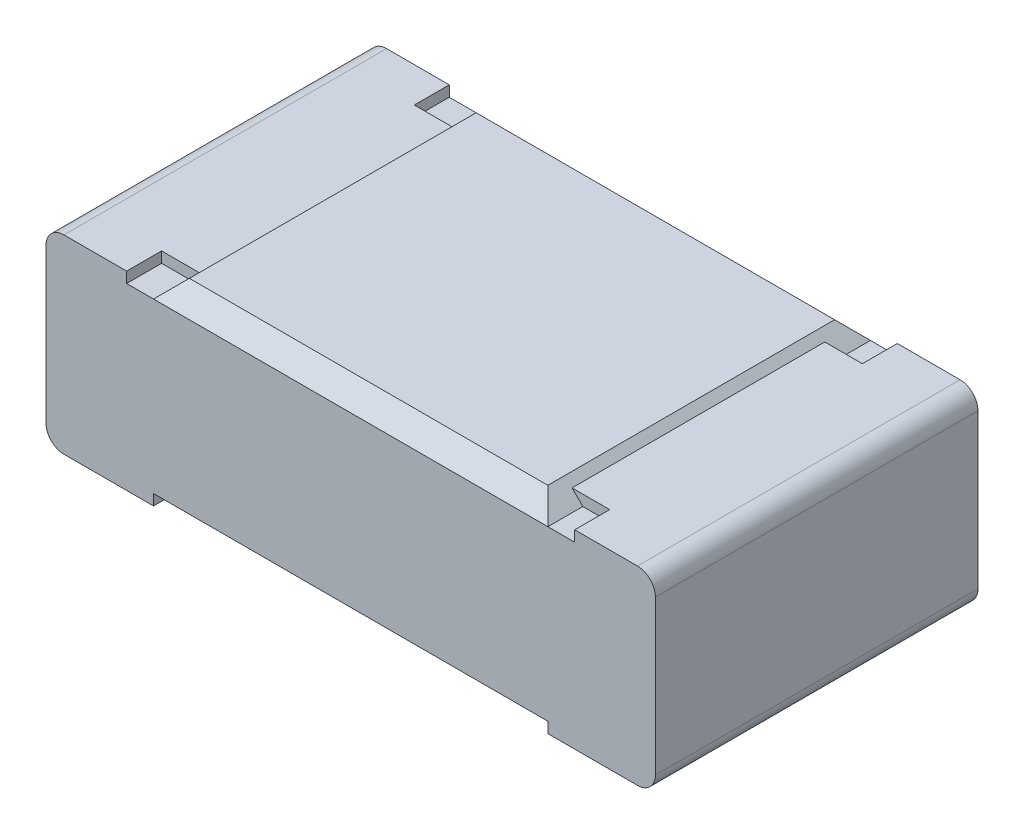
ISO-10303-21;
HEADER;
FILE_DESCRIPTION(('STEP AP214'),'2;1');
FILE_NAME('part.step','',(''),(''),'','','');
FILE_SCHEMA(('AUTOMOTIVE_DESIGN { 1 0 10303 214 1 1 1 1 }'));
ENDSEC;
DATA;
#1=APPLICATION_CONTEXT('core data for automotive mechanical design processes');
#2=APPLICATION_PROTOCOL_DEFINITION('international standard','automotive_design',2000,#1);
#3=PRODUCT_CONTEXT('',#1,'mechanical');
#4=PRODUCT('Part','Part','',(#3));
#5=PRODUCT_RELATED_PRODUCT_CATEGORY('part','',(#4));
#6=PRODUCT_DEFINITION_FORMATION('','',#4);
#7=PRODUCT_DEFINITION_CONTEXT('part definition',#1,'design');
#8=PRODUCT_DEFINITION('design','',#6,#7);
#9=PRODUCT_DEFINITION_SHAPE('','',#8);
#10=(LENGTH_UNIT() NAMED_UNIT(*) SI_UNIT(.MILLI.,.METRE.));
#11=(NAMED_UNIT(*) PLANE_ANGLE_UNIT() SI_UNIT($,.RADIAN.));
#12=(NAMED_UNIT(*) SI_UNIT($,.STERADIAN.) SOLID_ANGLE_UNIT());
#13=UNCERTAINTY_MEASURE_WITH_UNIT(LENGTH_MEASURE(1.E-05),#10,'distance_accuracy_value','');
#14=(GEOMETRIC_REPRESENTATION_CONTEXT(3) GLOBAL_UNCERTAINTY_ASSIGNED_CONTEXT((#13)) GLOBAL_UNIT_ASSIGNED_CONTEXT((#10,
#11,#12)) REPRESENTATION_CONTEXT('',''));
#15=CARTESIAN_POINT('',(0.,0.,0.));
#16=DIRECTION('',(0.,0.,1.));
#17=DIRECTION('',(1.,0.,0.));
#18=AXIS2_PLACEMENT_3D('',#15,#16,#17);
#19=CARTESIAN_POINT('',(-2.052710128787,-22.36241513081,-1.003337141905));
#20=DIRECTION('',(1.,0.,0.));
#21=DIRECTION('',(0.,0.,-1.));
#22=AXIS2_PLACEMENT_3D('',#19,#20,#21);
#23=PLANE('',#22);
#24=DIRECTION('',(0.,1.,0.));
#25=VECTOR('',#24,1.);
#26=CARTESIAN_POINT('',(-2.052710128787,-22.36241513081,-1.100837141905));
#27=LINE('',#26,#25);
#28=CARTESIAN_POINT('',(-2.052710128787,-22.3624151309644,-1.100837141905));
#29=VERTEX_POINT('',#28);
#30=CARTESIAN_POINT('',(-2.052710128787,-22.33241513081,-1.100837141905));
#31=VERTEX_POINT('',#30);
#32=EDGE_CURVE('E396',#29,#31,#27,.T.);
#33=ORIENTED_EDGE('',*,*,#32,.F.);
#34=DIRECTION('',(0.,0.,1.));
#35=VECTOR('',#34,1.);
#36=CARTESIAN_POINT('',(-2.052710128787,-22.3624151311376,-0.200837141905));
#37=LINE('',#36,#35);
#38=CARTESIAN_POINT('',(-2.052710128787,-22.3624151311376,-1.003337141905));
#39=VERTEX_POINT('',#38);
#40=EDGE_CURVE('E246',#39,#29,#37,.F.);
#41=ORIENTED_EDGE('',*,*,#40,.F.);
#42=DIRECTION('',(0.,1.,0.));
#43=VECTOR('',#42,1.);
#44=CARTESIAN_POINT('',(-2.052710128787,-22.36241513081,-1.003337141905));
#45=LINE('',#44,#43);
#46=CARTESIAN_POINT('',(-2.052710128787,-22.33241513081,-1.003337141905));
#47=VERTEX_POINT('',#46);
#48=EDGE_CURVE('E380',#39,#47,#45,.T.);
#49=ORIENTED_EDGE('',*,*,#48,.T.);
#50=DIRECTION('',(0.,0.,1.));
#51=VECTOR('',#50,1.);
#52=CARTESIAN_POINT('',(-2.052710128787,-22.33241513081,-0.200837141905));
#53=LINE('',#52,#51);
#54=EDGE_CURVE('E341',#31,#47,#53,.T.);
#55=ORIENTED_EDGE('',*,*,#54,.F.);
#56=EDGE_LOOP('',(#33,#41,#49,#55));
#57=FACE_BOUND('',#56,.T.);
#58=ADVANCED_FACE('F17',(#57),#23,.F.);
#59=CARTESIAN_POINT('',(-3.302710128787,-22.36241513081,-1.003337141905));
#60=DIRECTION('',(0.,0.,1.));
#61=DIRECTION('',(1.,0.,0.));
#62=AXIS2_PLACEMENT_3D('',#59,#60,#61);
#63=PLANE('',#62);
#64=DIRECTION('',(-1.,0.,0.));
#65=VECTOR('',#64,1.);
#66=CARTESIAN_POINT('',(-2.227710128787,-22.33241513081,-1.003337141905));
#67=LINE('',#66,#65);
#68=CARTESIAN_POINT('',(-2.15771012878251,-22.3324151308105,-1.003337141905));
#69=VERTEX_POINT('',#68);
#70=EDGE_CURVE('E337',#47,#69,#67,.T.);
#71=ORIENTED_EDGE('',*,*,#70,.F.);
#72=ORIENTED_EDGE('',*,*,#48,.F.);
#73=DIRECTION('',(-1.,5.24652203359E-10,0.));
#74=VECTOR('',#73,1.);
#75=CARTESIAN_POINT('',(-3.477710128525,-22.36241513039,-1.003337141905));
#76=LINE('',#75,#74);
#77=CARTESIAN_POINT('',(-2.12771012852529,-22.3624151310986,-1.003337141905));
#78=VERTEX_POINT('',#77);
#79=EDGE_CURVE('E225',#78,#39,#76,.F.);
#80=ORIENTED_EDGE('',*,*,#79,.F.);
#81=DIRECTION('',(-0.707106780815548,0.707106781557548,0.));
#82=VECTOR('',#81,1.);
#83=CARTESIAN_POINT('',(-2.127710128525,-22.3624151311,-1.003337141905));
#84=LINE('',#83,#82);
#85=EDGE_CURVE('E300',#69,#78,#84,.F.);
#86=ORIENTED_EDGE('',*,*,#85,.F.);
#87=EDGE_LOOP('',(#71,#72,#80,#86));
#88=FACE_BOUND('',#87,.T.);
#89=ADVANCED_FACE('F576',(#88),#63,.F.);
#90=CARTESIAN_POINT('',(-3.302710128787,-22.36241513081,-1.100837141905));
#91=DIRECTION('',(-1.,0.,0.));
#92=DIRECTION('',(0.,0.,1.));
#93=AXIS2_PLACEMENT_3D('',#90,#91,#92);
#94=PLANE('',#93);
#95=DIRECTION('',(0.,1.,0.));
#96=VECTOR('',#95,1.);
#97=CARTESIAN_POINT('',(-3.302710128787,-22.36241513081,-1.003337141905));
#98=LINE('',#97,#96);
#99=CARTESIAN_POINT('',(-3.302710128787,-22.33241513081,-1.003337141905));
#100=VERTEX_POINT('',#99);
#101=CARTESIAN_POINT('',(-3.302710128787,-22.3624151304818,-1.003337141905));
#102=VERTEX_POINT('',#101);
#103=EDGE_CURVE('E363',#100,#102,#98,.F.);
#104=ORIENTED_EDGE('',*,*,#103,.T.);
#105=DIRECTION('',(0.,0.,1.));
#106=VECTOR('',#105,1.);
#107=CARTESIAN_POINT('',(-3.302710128787,-22.3624151304818,-0.200837141905));
#108=LINE('',#107,#106);
#109=CARTESIAN_POINT('',(-3.302710128787,-22.362415130728,-1.100837141905));
#110=VERTEX_POINT('',#109);
#111=EDGE_CURVE('E376',#110,#102,#108,.T.);
#112=ORIENTED_EDGE('',*,*,#111,.F.);
#113=DIRECTION('',(0.,1.,0.));
#114=VECTOR('',#113,1.);
#115=CARTESIAN_POINT('',(-3.302710128787,-22.86241513081,-1.100837141905));
#116=LINE('',#115,#114);
#117=CARTESIAN_POINT('',(-3.302710128787,-22.33241513081,-1.100837141905));
#118=VERTEX_POINT('',#117);
#119=EDGE_CURVE('E236',#118,#110,#116,.F.);
#120=ORIENTED_EDGE('',*,*,#119,.F.);
#121=DIRECTION('',(0.,0.,1.));
#122=VECTOR('',#121,1.);
#123=CARTESIAN_POINT('',(-3.302710128787,-22.33241513081,-0.200837141905));
#124=LINE('',#123,#122);
#125=EDGE_CURVE('E322',#100,#118,#124,.F.);
#126=ORIENTED_EDGE('',*,*,#125,.F.);
#127=EDGE_LOOP('',(#104,#112,#120,#126));
#128=FACE_BOUND('',#127,.T.);
#129=ADVANCED_FACE('F927',(#128),#94,.F.);
#130=CARTESIAN_POINT('',(-3.302710128787,-22.36241513081,-1.003337141905));
#131=DIRECTION('',(0.,0.,1.));
#132=DIRECTION('',(1.,0.,0.));
#133=AXIS2_PLACEMENT_3D('',#130,#131,#132);
#134=PLANE('',#133);
#135=DIRECTION('',(-1.,5.24652203359E-10,0.));
#136=VECTOR('',#135,1.);
#137=CARTESIAN_POINT('',(-3.477710128525,-22.36241513039,-1.003337141905));
#138=LINE('',#137,#136);
#139=CARTESIAN_POINT('',(-3.22771012852519,-22.362415130521,-1.003337141905));
#140=VERTEX_POINT('',#139);
#141=EDGE_CURVE('E276',#102,#140,#138,.F.);
#142=ORIENTED_EDGE('',*,*,#141,.F.);
#143=ORIENTED_EDGE('',*,*,#103,.F.);
#144=DIRECTION('',(-1.,0.,0.));
#145=VECTOR('',#144,1.);
#146=CARTESIAN_POINT('',(-3.477710128787,-22.33241513081,-1.003337141905));
#147=LINE('',#146,#145);
#148=CARTESIAN_POINT('',(-3.19771012878276,-22.3324151308095,-1.003337141905));
#149=VERTEX_POINT('',#148);
#150=EDGE_CURVE('E326',#149,#100,#147,.T.);
#151=ORIENTED_EDGE('',*,*,#150,.F.);
#152=DIRECTION('',(-0.707106781557548,-0.707106780815548,0.));
#153=VECTOR('',#152,1.);
#154=CARTESIAN_POINT('',(-3.227710128525,-22.36241513052,-1.003337141905));
#155=LINE('',#154,#153);
#156=EDGE_CURVE('E299',#140,#149,#155,.F.);
#157=ORIENTED_EDGE('',*,*,#156,.F.);
#158=EDGE_LOOP('',(#142,#143,#151,#157));
#159=FACE_BOUND('',#158,.T.);
#160=ADVANCED_FACE('F633',(#159),#134,.F.);
#161=CARTESIAN_POINT('',(-2.052710128787,-22.36241513081,-0.200837141905));
#162=DIRECTION('',(1.,0.,0.));
#163=DIRECTION('',(0.,1.,0.));
#164=AXIS2_PLACEMENT_3D('',#161,#162,#163);
#165=PLANE('',#164);
#166=DIRECTION('',(0.,1.,0.));
#167=VECTOR('',#166,1.);
#168=CARTESIAN_POINT('',(-2.052710128787,-22.36241513081,-0.298337141905));
#169=LINE('',#168,#167);
#170=CARTESIAN_POINT('',(-2.052710128787,-22.33241513081,-0.298337141905));
#171=VERTEX_POINT('',#170);
#172=CARTESIAN_POINT('',(-2.052710128787,-22.3624151311376,-0.298337141905));
#173=VERTEX_POINT('',#172);
#174=EDGE_CURVE('E357',#171,#173,#169,.F.);
#175=ORIENTED_EDGE('',*,*,#174,.T.);
#176=DIRECTION('',(0.,0.,1.));
#177=VECTOR('',#176,1.);
#178=CARTESIAN_POINT('',(-2.052710128787,-22.3624151311376,-0.200837141905));
#179=LINE('',#178,#177);
#180=CARTESIAN_POINT('',(-2.052710128787,-22.3624151309644,-0.200837141905));
#181=VERTEX_POINT('',#180);
#182=EDGE_CURVE('E334',#181,#173,#179,.F.);
#183=ORIENTED_EDGE('',*,*,#182,.F.);
#184=DIRECTION('',(0.,1.,0.));
#185=VECTOR('',#184,1.);
#186=CARTESIAN_POINT('',(-2.052710128787,-22.36241513081,-0.200837141905));
#187=LINE('',#186,#185);
#188=CARTESIAN_POINT('',(-2.052710128787,-22.33241513081,-0.200837141904999));
#189=VERTEX_POINT('',#188);
#190=EDGE_CURVE('E359',#189,#181,#187,.F.);
#191=ORIENTED_EDGE('',*,*,#190,.F.);
#192=DIRECTION('',(0.,0.,1.));
#193=VECTOR('',#192,1.);
#194=CARTESIAN_POINT('',(-2.052710128787,-22.33241513081,-0.200837141905));
#195=LINE('',#194,#193);
#196=EDGE_CURVE('E338',#171,#189,#195,.T.);
#197=ORIENTED_EDGE('',*,*,#196,.F.);
#198=EDGE_LOOP('',(#175,#183,#191,#197));
#199=FACE_BOUND('',#198,.T.);
#200=ADVANCED_FACE('F598',(#199),#165,.F.);
#201=CARTESIAN_POINT('',(-2.052710128787,-22.36241513081,-0.298337141905));
#202=DIRECTION('',(0.,0.,-1.));
#203=DIRECTION('',(-1.,0.,0.));
#204=AXIS2_PLACEMENT_3D('',#201,#202,#203);
#205=PLANE('',#204);
#206=DIRECTION('',(-1.,5.24652203359E-10,0.));
#207=VECTOR('',#206,1.);
#208=CARTESIAN_POINT('',(-3.477710128525,-22.36241513039,-0.298337141905));
#209=LINE('',#208,#207);
#210=CARTESIAN_POINT('',(-2.12771012852529,-22.3624151310986,-0.298337141905));
#211=VERTEX_POINT('',#210);
#212=EDGE_CURVE('E351',#173,#211,#209,.T.);
#213=ORIENTED_EDGE('',*,*,#212,.F.);
#214=ORIENTED_EDGE('',*,*,#174,.F.);
#215=DIRECTION('',(-1.,0.,0.));
#216=VECTOR('',#215,1.);
#217=CARTESIAN_POINT('',(-2.227710128787,-22.33241513081,-0.298337141905));
#218=LINE('',#217,#216);
#219=CARTESIAN_POINT('',(-2.15771012878276,-22.3324151308105,-0.298337141905));
#220=VERTEX_POINT('',#219);
#221=EDGE_CURVE('E342',#220,#171,#218,.F.);
#222=ORIENTED_EDGE('',*,*,#221,.F.);
#223=DIRECTION('',(-0.707106780815548,0.707106781557548,0.));
#224=VECTOR('',#223,1.);
#225=CARTESIAN_POINT('',(-2.127710128525,-22.3624151311,-0.298337141905));
#226=LINE('',#225,#224);
#227=EDGE_CURVE('E345',#211,#220,#226,.T.);
#228=ORIENTED_EDGE('',*,*,#227,.F.);
#229=EDGE_LOOP('',(#213,#214,#222,#228));
#230=FACE_BOUND('',#229,.T.);
#231=ADVANCED_FACE('F566',(#230),#205,.F.);
#232=CARTESIAN_POINT('',(-2.227710128787,-22.33241513081,-0.200837141905));
#233=DIRECTION('',(0.,1.,0.));
#234=DIRECTION('',(-1.,0.,0.));
#235=AXIS2_PLACEMENT_3D('',#232,#233,#234);
#236=PLANE('',#235);
#237=ORIENTED_EDGE('',*,*,#54,.T.);
#238=ORIENTED_EDGE('',*,*,#70,.T.);
#239=DIRECTION('',(0.,0.,1.));
#240=VECTOR('',#239,1.);
#241=CARTESIAN_POINT('',(-2.15771012878276,-22.3324151308108,-0.200837141905));
#242=LINE('',#241,#240);
#243=EDGE_CURVE('E348',#220,#69,#242,.F.);
#244=ORIENTED_EDGE('',*,*,#243,.F.);
#245=ORIENTED_EDGE('',*,*,#221,.T.);
#246=ORIENTED_EDGE('',*,*,#196,.T.);
#247=DIRECTION('',(-1.,0.,0.));
#248=VECTOR('',#247,1.);
#249=CARTESIAN_POINT('',(-2.677710128787,-22.33241513081,-0.200837141905));
#250=LINE('',#249,#248);
#251=CARTESIAN_POINT('',(-1.877710128787,-22.33241513081,-0.200837141904999));
#252=VERTEX_POINT('',#251);
#253=EDGE_CURVE('E448',#189,#252,#250,.F.);
#254=ORIENTED_EDGE('',*,*,#253,.T.);
#255=DIRECTION('',(0.,0.,-1.));
#256=VECTOR('',#255,1.);
#257=CARTESIAN_POINT('',(-1.877710128787,-22.33241513081,-0.200837141905));
#258=LINE('',#257,#256);
#259=CARTESIAN_POINT('',(-1.877710128787,-22.33241513081,-1.100837141905));
#260=VERTEX_POINT('',#259);
#261=EDGE_CURVE('E198',#260,#252,#258,.F.);
#262=ORIENTED_EDGE('',*,*,#261,.F.);
#263=DIRECTION('',(-1.,0.,0.));
#264=VECTOR('',#263,1.);
#265=CARTESIAN_POINT('',(-2.677710128787,-22.33241513081,-1.100837141905));
#266=LINE('',#265,#264);
#267=EDGE_CURVE('E224',#31,#260,#266,.F.);
#268=ORIENTED_EDGE('',*,*,#267,.F.);
#269=EDGE_LOOP('',(#237,#238,#244,#245,#246,#254,#262,#268));
#270=FACE_BOUND('',#269,.T.);
#271=ADVANCED_FACE('F571',(#270),#236,.T.);
#272=CARTESIAN_POINT('',(-1.877710128787,-22.38241513081,-0.200837141905));
#273=DIRECTION('',(0.,0.,-1.));
#274=DIRECTION('',(-1.,0.,0.));
#275=AXIS2_PLACEMENT_3D('',#272,#273,#274);
#276=CYLINDRICAL_SURFACE('',#275,0.05);
#277=CARTESIAN_POINT('',(-1.877710128787,-22.38241513081,-1.100837141905));
#278=DIRECTION('',(0.,0.,-1.));
#279=DIRECTION('',(-1.,0.,0.));
#280=AXIS2_PLACEMENT_3D('',#277,#278,#279);
#281=CIRCLE('',#280,0.05);
#282=CARTESIAN_POINT('',(-1.827710128787,-22.38241513081,-1.100837141905));
#283=VERTEX_POINT('',#282);
#284=EDGE_CURVE('E20',#260,#283,#281,.T.);
#285=ORIENTED_EDGE('',*,*,#284,.F.);
#286=ORIENTED_EDGE('',*,*,#261,.T.);
#287=CARTESIAN_POINT('',(-1.877710128787,-22.38241513081,-0.200837141905));
#288=DIRECTION('',(0.,0.,-1.));
#289=DIRECTION('',(-1.,0.,0.));
#290=AXIS2_PLACEMENT_3D('',#287,#288,#289);
#291=CIRCLE('',#290,0.05);
#292=CARTESIAN_POINT('',(-1.827710128787,-22.38241513081,-0.200837141904999));
#293=VERTEX_POINT('',#292);
#294=EDGE_CURVE('E209',#252,#293,#291,.T.);
#295=ORIENTED_EDGE('',*,*,#294,.T.);
#296=DIRECTION('',(0.,0.,-1.));
#297=VECTOR('',#296,1.);
#298=CARTESIAN_POINT('',(-1.827710128787,-22.38241513081,-0.200837141905));
#299=LINE('',#298,#297);
#300=EDGE_CURVE('E203',#283,#293,#299,.F.);
#301=ORIENTED_EDGE('',*,*,#300,.F.);
#302=EDGE_LOOP('',(#285,#286,#295,#301));
#303=FACE_BOUND('',#302,.T.);
#304=ADVANCED_FACE('F205',(#303),#276,.T.);
#305=CARTESIAN_POINT('',(-1.827710128787,-22.38241513081,-0.200837141905));
#306=DIRECTION('',(1.,0.,0.));
#307=DIRECTION('',(0.,0.,-1.));
#308=AXIS2_PLACEMENT_3D('',#305,#306,#307);
#309=PLANE('',#308);
#310=DIRECTION('',(0.,1.,0.));
#311=VECTOR('',#310,1.);
#312=CARTESIAN_POINT('',(-1.827710128787,-22.86241513081,-1.100837141905));
#313=LINE('',#312,#311);
#314=CARTESIAN_POINT('',(-1.827710128787,-22.81241513081,-1.100837141905));
#315=VERTEX_POINT('',#314);
#316=EDGE_CURVE('E215',#283,#315,#313,.F.);
#317=ORIENTED_EDGE('',*,*,#316,.F.);
#318=ORIENTED_EDGE('',*,*,#300,.T.);
#319=DIRECTION('',(0.,1.,0.));
#320=VECTOR('',#319,1.);
#321=CARTESIAN_POINT('',(-1.827710128787,-22.86241513081,-0.200837141904999));
#322=LINE('',#321,#320);
#323=CARTESIAN_POINT('',(-1.827710128787,-22.81241513081,-0.200837141904999));
#324=VERTEX_POINT('',#323);
#325=EDGE_CURVE('E446',#293,#324,#322,.F.);
#326=ORIENTED_EDGE('',*,*,#325,.T.);
#327=DIRECTION('',(0.,0.,-1.));
#328=VECTOR('',#327,1.);
#329=CARTESIAN_POINT('',(-1.827710128787,-22.81241513081,-0.200837141905));
#330=LINE('',#329,#328);
#331=EDGE_CURVE('E212',#315,#324,#330,.F.);
#332=ORIENTED_EDGE('',*,*,#331,.F.);
#333=EDGE_LOOP('',(#317,#318,#326,#332));
#334=FACE_BOUND('',#333,.T.);
#335=ADVANCED_FACE('F216',(#334),#309,.T.);
#336=CARTESIAN_POINT('',(-1.877710128787,-22.81241513081,-0.200837141905));
#337=DIRECTION('',(0.,0.,-1.));
#338=DIRECTION('',(-1.,0.,0.));
#339=AXIS2_PLACEMENT_3D('',#336,#337,#338);
#340=CYLINDRICAL_SURFACE('',#339,0.05);
#341=CARTESIAN_POINT('',(-1.877710128787,-22.81241513081,-1.100837141905));
#342=DIRECTION('',(0.,0.,-1.));
#343=DIRECTION('',(-1.,0.,0.));
#344=AXIS2_PLACEMENT_3D('',#341,#342,#343);
#345=CIRCLE('',#344,0.05);
#346=CARTESIAN_POINT('',(-1.877710128787,-22.86241513081,-1.100837141905));
#347=VERTEX_POINT('',#346);
#348=EDGE_CURVE('E220',#315,#347,#345,.T.);
#349=ORIENTED_EDGE('',*,*,#348,.F.);
#350=ORIENTED_EDGE('',*,*,#331,.T.);
#351=CARTESIAN_POINT('',(-1.877710128787,-22.81241513081,-0.200837141905));
#352=DIRECTION('',(0.,0.,-1.));
#353=DIRECTION('',(-1.,0.,0.));
#354=AXIS2_PLACEMENT_3D('',#351,#352,#353);
#355=CIRCLE('',#354,0.05);
#356=CARTESIAN_POINT('',(-1.877710128787,-22.86241513081,-0.200837141904999));
#357=VERTEX_POINT('',#356);
#358=EDGE_CURVE('E443',#324,#357,#355,.T.);
#359=ORIENTED_EDGE('',*,*,#358,.T.);
#360=DIRECTION('',(0.,0.,1.));
#361=VECTOR('',#360,1.);
#362=CARTESIAN_POINT('',(-1.877710128787,-22.86241513081,-0.200837141905));
#363=LINE('',#362,#361);
#364=EDGE_CURVE('E331',#347,#357,#363,.T.);
#365=ORIENTED_EDGE('',*,*,#364,.F.);
#366=EDGE_LOOP('',(#349,#350,#359,#365));
#367=FACE_BOUND('',#366,.T.);
#368=ADVANCED_FACE('F461',(#367),#340,.T.);
#369=CARTESIAN_POINT('',(-3.477710128787,-22.81241513081,-0.200837141905));
#370=DIRECTION('',(0.,0.,-1.));
#371=DIRECTION('',(-1.,0.,0.));
#372=AXIS2_PLACEMENT_3D('',#369,#370,#371);
#373=CYLINDRICAL_SURFACE('',#372,0.05);
#374=CARTESIAN_POINT('',(-3.477710128787,-22.81241513081,-1.100837141905));
#375=DIRECTION('',(0.,0.,-1.));
#376=DIRECTION('',(-1.,0.,0.));
#377=AXIS2_PLACEMENT_3D('',#374,#375,#376);
#378=CIRCLE('',#377,0.05);
#379=CARTESIAN_POINT('',(-3.477710128787,-22.86241513081,-1.100837141905));
#380=VERTEX_POINT('',#379);
#381=CARTESIAN_POINT('',(-3.527710128787,-22.81241513081,-1.100837141905));
#382=VERTEX_POINT('',#381);
#383=EDGE_CURVE('E454',#380,#382,#378,.T.);
#384=ORIENTED_EDGE('',*,*,#383,.F.);
#385=DIRECTION('',(0.,0.,1.));
#386=VECTOR('',#385,1.);
#387=CARTESIAN_POINT('',(-3.477710128787,-22.86241513081,-0.200837141905));
#388=LINE('',#387,#386);
#389=CARTESIAN_POINT('',(-3.477710128787,-22.86241513081,-0.200837141905001));
#390=VERTEX_POINT('',#389);
#391=EDGE_CURVE('E269',#390,#380,#388,.F.);
#392=ORIENTED_EDGE('',*,*,#391,.F.);
#393=CARTESIAN_POINT('',(-3.477710128787,-22.81241513081,-0.200837141905));
#394=DIRECTION('',(0.,0.,-1.));
#395=DIRECTION('',(-1.,0.,0.));
#396=AXIS2_PLACEMENT_3D('',#393,#394,#395);
#397=CIRCLE('',#396,0.05);
#398=CARTESIAN_POINT('',(-3.527710128787,-22.81241513081,-0.200837141905001));
#399=VERTEX_POINT('',#398);
#400=EDGE_CURVE('E440',#390,#399,#397,.T.);
#401=ORIENTED_EDGE('',*,*,#400,.T.);
#402=DIRECTION('',(0.,0.,1.));
#403=VECTOR('',#402,1.);
#404=CARTESIAN_POINT('',(-3.527710128787,-22.81241513081,-0.200837141905));
#405=LINE('',#404,#403);
#406=EDGE_CURVE('E327',#382,#399,#405,.T.);
#407=ORIENTED_EDGE('',*,*,#406,.F.);
#408=EDGE_LOOP('',(#384,#392,#401,#407));
#409=FACE_BOUND('',#408,.T.);
#410=ADVANCED_FACE('F611',(#409),#373,.T.);
#411=CARTESIAN_POINT('',(-3.527710128787,-22.81241513081,-0.200837141905));
#412=DIRECTION('',(-1.,0.,0.));
#413=DIRECTION('',(0.,-1.,0.));
#414=AXIS2_PLACEMENT_3D('',#411,#412,#413);
#415=PLANE('',#414);
#416=DIRECTION('',(0.,1.,0.));
#417=VECTOR('',#416,1.);
#418=CARTESIAN_POINT('',(-3.527710128787,-22.86241513081,-1.100837141905));
#419=LINE('',#418,#417);
#420=CARTESIAN_POINT('',(-3.527710128787,-22.38241513081,-1.100837141905));
#421=VERTEX_POINT('',#420);
#422=EDGE_CURVE('E453',#382,#421,#419,.T.);
#423=ORIENTED_EDGE('',*,*,#422,.F.);
#424=ORIENTED_EDGE('',*,*,#406,.T.);
#425=DIRECTION('',(0.,1.,0.));
#426=VECTOR('',#425,1.);
#427=CARTESIAN_POINT('',(-3.527710128787,-22.86241513081,-0.200837141905001));
#428=LINE('',#427,#426);
#429=CARTESIAN_POINT('',(-3.527710128787,-22.38241513081,-0.200837141905001));
#430=VERTEX_POINT('',#429);
#431=EDGE_CURVE('E439',#399,#430,#428,.T.);
#432=ORIENTED_EDGE('',*,*,#431,.T.);
#433=DIRECTION('',(0.,0.,-1.));
#434=VECTOR('',#433,1.);
#435=CARTESIAN_POINT('',(-3.527710128787,-22.38241513081,-0.200837141905));
#436=LINE('',#435,#434);
#437=EDGE_CURVE('E323',#421,#430,#436,.F.);
#438=ORIENTED_EDGE('',*,*,#437,.F.);
#439=EDGE_LOOP('',(#423,#424,#432,#438));
#440=FACE_BOUND('',#439,.T.);
#441=ADVANCED_FACE('F615',(#440),#415,.T.);
#442=CARTESIAN_POINT('',(-3.477710128787,-22.38241513081,-0.200837141905));
#443=DIRECTION('',(0.,0.,-1.));
#444=DIRECTION('',(-1.,0.,0.));
#445=AXIS2_PLACEMENT_3D('',#442,#443,#444);
#446=CYLINDRICAL_SURFACE('',#445,0.05);
#447=CARTESIAN_POINT('',(-3.477710128787,-22.38241513081,-1.100837141905));
#448=DIRECTION('',(0.,0.,-1.));
#449=DIRECTION('',(-1.,0.,0.));
#450=AXIS2_PLACEMENT_3D('',#447,#448,#449);
#451=CIRCLE('',#450,0.05);
#452=CARTESIAN_POINT('',(-3.477710128787,-22.33241513081,-1.100837141905));
#453=VERTEX_POINT('',#452);
#454=EDGE_CURVE('E449',#421,#453,#451,.T.);
#455=ORIENTED_EDGE('',*,*,#454,.F.);
#456=ORIENTED_EDGE('',*,*,#437,.T.);
#457=CARTESIAN_POINT('',(-3.477710128787,-22.38241513081,-0.200837141905));
#458=DIRECTION('',(0.,0.,-1.));
#459=DIRECTION('',(-1.,0.,0.));
#460=AXIS2_PLACEMENT_3D('',#457,#458,#459);
#461=CIRCLE('',#460,0.05);
#462=CARTESIAN_POINT('',(-3.477710128787,-22.33241513081,-0.200837141905));
#463=VERTEX_POINT('',#462);
#464=EDGE_CURVE('E436',#430,#463,#461,.T.);
#465=ORIENTED_EDGE('',*,*,#464,.T.);
#466=DIRECTION('',(0.,0.,1.));
#467=VECTOR('',#466,1.);
#468=CARTESIAN_POINT('',(-3.477710128787,-22.33241513081,-0.200837141905));
#469=LINE('',#468,#467);
#470=EDGE_CURVE('E317',#453,#463,#469,.T.);
#471=ORIENTED_EDGE('',*,*,#470,.F.);
#472=EDGE_LOOP('',(#455,#456,#465,#471));
#473=FACE_BOUND('',#472,.T.);
#474=ADVANCED_FACE('F619',(#473),#446,.T.);
#475=CARTESIAN_POINT('',(-3.477710128787,-22.33241513081,-0.200837141905));
#476=DIRECTION('',(0.,1.,0.));
#477=DIRECTION('',(-1.,0.,0.));
#478=AXIS2_PLACEMENT_3D('',#475,#476,#477);
#479=PLANE('',#478);
#480=DIRECTION('',(0.,0.,1.));
#481=VECTOR('',#480,1.);
#482=CARTESIAN_POINT('',(-3.302710128787,-22.33241513081,-0.298337141905));
#483=LINE('',#482,#481);
#484=CARTESIAN_POINT('',(-3.302710128787,-22.33241513081,-0.200837141905001));
#485=VERTEX_POINT('',#484);
#486=CARTESIAN_POINT('',(-3.302710128787,-22.33241513081,-0.298337141905001));
#487=VERTEX_POINT('',#486);
#488=EDGE_CURVE('E307',#485,#487,#483,.F.);
#489=ORIENTED_EDGE('',*,*,#488,.T.);
#490=DIRECTION('',(-1.,0.,0.));
#491=VECTOR('',#490,1.);
#492=CARTESIAN_POINT('',(-2.052710128787,-22.33241513081,-0.298337141905));
#493=LINE('',#492,#491);
#494=CARTESIAN_POINT('',(-3.19771012878219,-22.3324151308098,-0.298337141905));
#495=VERTEX_POINT('',#494);
#496=EDGE_CURVE('E306',#487,#495,#493,.F.);
#497=ORIENTED_EDGE('',*,*,#496,.T.);
#498=DIRECTION('',(0.,0.,1.));
#499=VECTOR('',#498,1.);
#500=CARTESIAN_POINT('',(-3.19771012878276,-22.3324151308092,-1.100837141905));
#501=LINE('',#500,#499);
#502=EDGE_CURVE('E289',#149,#495,#501,.T.);
#503=ORIENTED_EDGE('',*,*,#502,.F.);
#504=ORIENTED_EDGE('',*,*,#150,.T.);
#505=ORIENTED_EDGE('',*,*,#125,.T.);
#506=DIRECTION('',(-1.,0.,0.));
#507=VECTOR('',#506,1.);
#508=CARTESIAN_POINT('',(-2.677710128787,-22.33241513081,-1.100837141905));
#509=LINE('',#508,#507);
#510=EDGE_CURVE('E452',#453,#118,#509,.F.);
#511=ORIENTED_EDGE('',*,*,#510,.F.);
#512=ORIENTED_EDGE('',*,*,#470,.T.);
#513=DIRECTION('',(-1.,0.,0.));
#514=VECTOR('',#513,1.);
#515=CARTESIAN_POINT('',(-2.677710128787,-22.33241513081,-0.200837141905));
#516=LINE('',#515,#514);
#517=EDGE_CURVE('E438',#463,#485,#516,.F.);
#518=ORIENTED_EDGE('',*,*,#517,.T.);
#519=EDGE_LOOP('',(#489,#497,#503,#504,#505,#511,#512,#518));
#520=FACE_BOUND('',#519,.T.);
#521=ADVANCED_FACE('F623',(#520),#479,.T.);
#522=CARTESIAN_POINT('',(-3.302710128787,-22.36241513081,-0.298337141905));
#523=DIRECTION('',(-1.,0.,0.));
#524=DIRECTION('',(0.,-1.,0.));
#525=AXIS2_PLACEMENT_3D('',#522,#523,#524);
#526=PLANE('',#525);
#527=DIRECTION('',(0.,1.,0.));
#528=VECTOR('',#527,1.);
#529=CARTESIAN_POINT('',(-3.302710128787,-22.86241513081,-0.200837141905001));
#530=LINE('',#529,#528);
#531=CARTESIAN_POINT('',(-3.302710128787,-22.362415130728,-0.200837141905001));
#532=VERTEX_POINT('',#531);
#533=EDGE_CURVE('E646',#485,#532,#530,.F.);
#534=ORIENTED_EDGE('',*,*,#533,.T.);
#535=DIRECTION('',(0.,0.,1.));
#536=VECTOR('',#535,1.);
#537=CARTESIAN_POINT('',(-3.302710128787,-22.3624151304818,-0.200837141905));
#538=LINE('',#537,#536);
#539=CARTESIAN_POINT('',(-3.302710128787,-22.3624151304818,-0.298337141905001));
#540=VERTEX_POINT('',#539);
#541=EDGE_CURVE('E644',#540,#532,#538,.T.);
#542=ORIENTED_EDGE('',*,*,#541,.F.);
#543=DIRECTION('',(0.,1.,0.));
#544=VECTOR('',#543,1.);
#545=CARTESIAN_POINT('',(-3.302710128787,-22.36241513081,-0.298337141905002));
#546=LINE('',#545,#544);
#547=EDGE_CURVE('E303',#540,#487,#546,.T.);
#548=ORIENTED_EDGE('',*,*,#547,.T.);
#549=ORIENTED_EDGE('',*,*,#488,.F.);
#550=EDGE_LOOP('',(#534,#542,#548,#549));
#551=FACE_BOUND('',#550,.T.);
#552=ADVANCED_FACE('F661',(#551),#526,.F.);
#553=CARTESIAN_POINT('',(-2.052710128787,-22.36241513081,-0.298337141905));
#554=DIRECTION('',(0.,0.,-1.));
#555=DIRECTION('',(-1.,0.,0.));
#556=AXIS2_PLACEMENT_3D('',#553,#554,#555);
#557=PLANE('',#556);
#558=ORIENTED_EDGE('',*,*,#496,.F.);
#559=ORIENTED_EDGE('',*,*,#547,.F.);
#560=DIRECTION('',(-1.,5.24652203359E-10,0.));
#561=VECTOR('',#560,1.);
#562=CARTESIAN_POINT('',(-3.477710128525,-22.36241513039,-0.298337141905));
#563=LINE('',#562,#561);
#564=CARTESIAN_POINT('',(-3.227710128525,-22.3624151305203,-0.298337141905));
#565=VERTEX_POINT('',#564);
#566=EDGE_CURVE('E310',#565,#540,#563,.T.);
#567=ORIENTED_EDGE('',*,*,#566,.F.);
#568=DIRECTION('',(-0.707106781557548,-0.707106780815548,0.));
#569=VECTOR('',#568,1.);
#570=CARTESIAN_POINT('',(-3.227710128525,-22.36241513052,-0.298337141905));
#571=LINE('',#570,#569);
#572=EDGE_CURVE('E285',#495,#565,#571,.T.);
#573=ORIENTED_EDGE('',*,*,#572,.F.);
#574=EDGE_LOOP('',(#558,#559,#567,#573));
#575=FACE_BOUND('',#574,.T.);
#576=ADVANCED_FACE('F640',(#575),#557,.F.);
#577=CARTESIAN_POINT('',(-2.127710128525,-22.3624151311,-0.200837141905));
#578=DIRECTION('',(0.707106781557548,0.707106780815548,0.));
#579=DIRECTION('',(-0.707106780815548,0.707106781557548,0.));
#580=AXIS2_PLACEMENT_3D('',#577,#578,#579);
#581=PLANE('',#580);
#582=DIRECTION('',(-0.577350268866299,0.577350269502745,-0.577350269199834));
#583=VECTOR('',#582,1.);
#584=CARTESIAN_POINT('',(-2.127710128525,-22.3624151310986,-0.200837141903555));
#585=LINE('',#584,#583);
#586=CARTESIAN_POINT('',(-2.12771012860958,-22.3624151309421,-0.200837141916722));
#587=VERTEX_POINT('',#586);
#588=CARTESIAN_POINT('',(-2.177710128498,-22.3124151310711,-0.25083714190544));
#589=VERTEX_POINT('',#588);
#590=EDGE_CURVE('E294',#587,#589,#585,.T.);
#591=ORIENTED_EDGE('',*,*,#590,.F.);
#592=DIRECTION('',(0.,0.,1.));
#593=VECTOR('',#592,1.);
#594=CARTESIAN_POINT('',(-2.127710128525,-22.3624151310983,-0.200837141905));
#595=LINE('',#594,#593);
#596=EDGE_CURVE('E354',#211,#587,#595,.T.);
#597=ORIENTED_EDGE('',*,*,#596,.F.);
#598=ORIENTED_EDGE('',*,*,#227,.T.);
#599=ORIENTED_EDGE('',*,*,#243,.T.);
#600=ORIENTED_EDGE('',*,*,#85,.T.);
#601=DIRECTION('',(0.,0.,1.));
#602=VECTOR('',#601,1.);
#603=CARTESIAN_POINT('',(-2.127710128525,-22.3624151310983,-0.200837141905));
#604=LINE('',#603,#602);
#605=CARTESIAN_POINT('',(-2.127710128525,-22.3624151309546,-1.100837141905));
#606=VERTEX_POINT('',#605);
#607=EDGE_CURVE('E228',#606,#78,#604,.T.);
#608=ORIENTED_EDGE('',*,*,#607,.F.);
#609=DIRECTION('',(0.577350268866299,-0.577350269502745,-0.577350269199833));
#610=VECTOR('',#609,1.);
#611=CARTESIAN_POINT('',(-2.177710128498,-22.3124151310719,-1.05083714190312));
#612=LINE('',#611,#610);
#613=CARTESIAN_POINT('',(-2.17771012862838,-22.3124151308987,-1.05083714173041));
#614=VERTEX_POINT('',#613);
#615=EDGE_CURVE('E249',#614,#606,#612,.T.);
#616=ORIENTED_EDGE('',*,*,#615,.F.);
#617=DIRECTION('',(0.,0.,1.));
#618=VECTOR('',#617,1.);
#619=CARTESIAN_POINT('',(-2.177710128498,-22.3124151310723,-0.650837141905));
#620=LINE('',#619,#618);
#621=EDGE_CURVE('E297',#589,#614,#620,.F.);
#622=ORIENTED_EDGE('',*,*,#621,.F.);
#623=EDGE_LOOP('',(#591,#597,#598,#599,#600,#608,#616,#622));
#624=FACE_BOUND('',#623,.T.);
#625=ADVANCED_FACE('F559',(#624),#581,.T.);
#626=CARTESIAN_POINT('',(-2.677710128498,-22.31241513081,-0.650837141905));
#627=DIRECTION('',(5.24652203359E-10,1.,0.));
#628=DIRECTION('',(-1.,5.24652203359E-10,0.));
#629=AXIS2_PLACEMENT_3D('',#626,#627,#628);
#630=PLANE('',#629);
#631=DIRECTION('',(1.,-2.62325390485111E-10,-2.62325390485111E-10));
#632=VECTOR('',#631,1.);
#633=CARTESIAN_POINT('',(-3.227710128525,-22.312415130795,-0.250837141629998));
#634=LINE('',#633,#632);
#635=CARTESIAN_POINT('',(-3.17771012853192,-22.3124151306779,-0.250837141741322));
#636=VERTEX_POINT('',#635);
#637=EDGE_CURVE('E290',#589,#636,#634,.F.);
#638=ORIENTED_EDGE('',*,*,#637,.F.);
#639=ORIENTED_EDGE('',*,*,#621,.T.);
#640=DIRECTION('',(1.,-2.62326806565436E-10,2.62326806565436E-10));
#641=VECTOR('',#640,1.);
#642=CARTESIAN_POINT('',(-2.127710128525,-22.312415130825,-1.05083714163));
#643=LINE('',#642,#641);
#644=CARTESIAN_POINT('',(-3.17771012849876,-22.3124151305489,-1.0508371419053));
#645=VERTEX_POINT('',#644);
#646=EDGE_CURVE('E263',#645,#614,#643,.T.);
#647=ORIENTED_EDGE('',*,*,#646,.F.);
#648=DIRECTION('',(0.,0.,1.));
#649=VECTOR('',#648,1.);
#650=CARTESIAN_POINT('',(-3.17771012850027,-22.3124151305477,-1.100837141905));
#651=LINE('',#650,#649);
#652=EDGE_CURVE('E288',#636,#645,#651,.F.);
#653=ORIENTED_EDGE('',*,*,#652,.F.);
#654=EDGE_LOOP('',(#638,#639,#647,#653));
#655=FACE_BOUND('',#654,.T.);
#656=ADVANCED_FACE('F585',(#655),#630,.T.);
#657=CARTESIAN_POINT('',(-3.227710128525,-22.36241513052,-1.100837141905));
#658=DIRECTION('',(-0.707106780815548,0.707106781557548,0.));
#659=DIRECTION('',(-0.707106781557548,-0.707106780815548,0.));
#660=AXIS2_PLACEMENT_3D('',#657,#658,#659);
#661=PLANE('',#660);
#662=DIRECTION('',(0.577350269512954,0.577350268876503,0.57735026917942));
#663=VECTOR('',#662,1.);
#664=CARTESIAN_POINT('',(-3.227710128525,-22.3624151305214,-1.10083714190356));
#665=LINE('',#664,#663);
#666=CARTESIAN_POINT('',(-3.22771012853708,-22.3624151306052,-1.10083714191672));
#667=VERTEX_POINT('',#666);
#668=EDGE_CURVE('E266',#667,#645,#665,.T.);
#669=ORIENTED_EDGE('',*,*,#668,.F.);
#670=DIRECTION('',(0.,0.,1.));
#671=VECTOR('',#670,1.);
#672=CARTESIAN_POINT('',(-3.227710128525,-22.3624151305212,-0.200837141905));
#673=LINE('',#672,#671);
#674=EDGE_CURVE('E272',#140,#667,#673,.F.);
#675=ORIENTED_EDGE('',*,*,#674,.F.);
#676=ORIENTED_EDGE('',*,*,#156,.T.);
#677=ORIENTED_EDGE('',*,*,#502,.T.);
#678=ORIENTED_EDGE('',*,*,#572,.T.);
#679=DIRECTION('',(0.,0.,1.));
#680=VECTOR('',#679,1.);
#681=CARTESIAN_POINT('',(-3.227710128525,-22.3624151305212,-0.200837141905));
#682=LINE('',#681,#680);
#683=CARTESIAN_POINT('',(-3.227710128525,-22.3624151305203,-0.200837141905));
#684=VERTEX_POINT('',#683);
#685=EDGE_CURVE('E313',#684,#565,#682,.F.);
#686=ORIENTED_EDGE('',*,*,#685,.F.);
#687=DIRECTION('',(-0.577350269512955,-0.577350268876505,0.577350269179418));
#688=VECTOR('',#687,1.);
#689=CARTESIAN_POINT('',(-3.177710128498,-22.3124151305481,-0.250837141903115));
#690=LINE('',#689,#688);
#691=EDGE_CURVE('E293',#636,#684,#690,.T.);
#692=ORIENTED_EDGE('',*,*,#691,.F.);
#693=ORIENTED_EDGE('',*,*,#652,.T.);
#694=EDGE_LOOP('',(#669,#675,#676,#677,#678,#686,#692,#693));
#695=FACE_BOUND('',#694,.T.);
#696=ADVANCED_FACE('F589',(#695),#661,.T.);
#697=CARTESIAN_POINT('',(-3.227710128787,-22.86241513081,-0.200837141905));
#698=DIRECTION('',(0.,-1.,0.));
#699=DIRECTION('',(1.,0.,0.));
#700=AXIS2_PLACEMENT_3D('',#697,#698,#699);
#701=PLANE('',#700);
#702=DIRECTION('',(-1.,0.,0.));
#703=VECTOR('',#702,1.);
#704=CARTESIAN_POINT('',(-2.677710128787,-22.86241513081,-1.100837141905));
#705=LINE('',#704,#703);
#706=CARTESIAN_POINT('',(-3.227710128787,-22.86241513081,-1.100837141905));
#707=VERTEX_POINT('',#706);
#708=EDGE_CURVE('E456',#707,#380,#705,.T.);
#709=ORIENTED_EDGE('',*,*,#708,.F.);
#710=DIRECTION('',(0.,0.,1.));
#711=VECTOR('',#710,1.);
#712=CARTESIAN_POINT('',(-3.227710128787,-22.86241513081,-0.200837141905));
#713=LINE('',#712,#711);
#714=CARTESIAN_POINT('',(-3.227710128787,-22.86241513081,-0.200837141905));
#715=VERTEX_POINT('',#714);
#716=EDGE_CURVE('E279',#715,#707,#713,.F.);
#717=ORIENTED_EDGE('',*,*,#716,.F.);
#718=DIRECTION('',(-1.,0.,0.));
#719=VECTOR('',#718,1.);
#720=CARTESIAN_POINT('',(-2.677710128787,-22.86241513081,-0.200837141905));
#721=LINE('',#720,#719);
#722=EDGE_CURVE('E442',#715,#390,#721,.T.);
#723=ORIENTED_EDGE('',*,*,#722,.T.);
#724=ORIENTED_EDGE('',*,*,#391,.T.);
#725=EDGE_LOOP('',(#709,#717,#723,#724));
#726=FACE_BOUND('',#725,.T.);
#727=ADVANCED_FACE('F607',(#726),#701,.T.);
#728=CARTESIAN_POINT('',(-2.127710128525,-22.3624151311,-1.100837141905));
#729=DIRECTION('',(3.70986127618863E-10,0.707106781186548,-0.707106781186548));
#730=DIRECTION('',(0.,0.707106781186548,0.707106781186548));
#731=AXIS2_PLACEMENT_3D('',#728,#729,#730);
#732=PLANE('',#731);
#733=ORIENTED_EDGE('',*,*,#646,.T.);
#734=ORIENTED_EDGE('',*,*,#615,.T.);
#735=DIRECTION('',(-1.,0.,0.));
#736=VECTOR('',#735,1.);
#737=CARTESIAN_POINT('',(-2.677710128787,-22.36241513052,-1.100837141905));
#738=LINE('',#737,#736);
#739=EDGE_CURVE('E243',#667,#606,#738,.F.);
#740=ORIENTED_EDGE('',*,*,#739,.F.);
#741=ORIENTED_EDGE('',*,*,#668,.T.);
#742=EDGE_LOOP('',(#733,#734,#740,#741));
#743=FACE_BOUND('',#742,.T.);
#744=ADVANCED_FACE('F582',(#743),#732,.T.);
#745=CARTESIAN_POINT('',(-3.477710128525,-22.36241513039,-0.200837141905));
#746=DIRECTION('',(5.24652203359E-10,1.,0.));
#747=DIRECTION('',(-1.,5.24652203359E-10,0.));
#748=AXIS2_PLACEMENT_3D('',#745,#746,#747);
#749=PLANE('',#748);
#750=ORIENTED_EDGE('',*,*,#607,.T.);
#751=ORIENTED_EDGE('',*,*,#79,.T.);
#752=ORIENTED_EDGE('',*,*,#40,.T.);
#753=DIRECTION('',(-1.,0.,0.));
#754=VECTOR('',#753,1.);
#755=CARTESIAN_POINT('',(-2.677710128787,-22.3624151311,-1.100837141905));
#756=LINE('',#755,#754);
#757=EDGE_CURVE('E239',#606,#29,#756,.F.);
#758=ORIENTED_EDGE('',*,*,#757,.F.);
#759=EDGE_LOOP('',(#750,#751,#752,#758));
#760=FACE_BOUND('',#759,.T.);
#761=ADVANCED_FACE('F579',(#760),#749,.T.);
#762=CARTESIAN_POINT('',(-3.477710128525,-22.36241513039,-0.200837141905));
#763=DIRECTION('',(5.24652203359E-10,1.,0.));
#764=DIRECTION('',(-1.,5.24652203359E-10,0.));
#765=AXIS2_PLACEMENT_3D('',#762,#763,#764);
#766=PLANE('',#765);
#767=ORIENTED_EDGE('',*,*,#674,.T.);
#768=DIRECTION('',(-1.,0.,0.));
#769=VECTOR('',#768,1.);
#770=CARTESIAN_POINT('',(-2.677710128787,-22.36241513081,-1.100837141905));
#771=LINE('',#770,#769);
#772=EDGE_CURVE('E242',#110,#667,#771,.F.);
#773=ORIENTED_EDGE('',*,*,#772,.F.);
#774=ORIENTED_EDGE('',*,*,#111,.T.);
#775=ORIENTED_EDGE('',*,*,#141,.T.);
#776=EDGE_LOOP('',(#767,#773,#774,#775));
#777=FACE_BOUND('',#776,.T.);
#778=ADVANCED_FACE('F628',(#777),#766,.T.);
#779=CARTESIAN_POINT('',(-1.877710128787,-22.86241513081,-0.200837141905));
#780=DIRECTION('',(0.,-1.,0.));
#781=DIRECTION('',(1.,0.,0.));
#782=AXIS2_PLACEMENT_3D('',#779,#780,#781);
#783=PLANE('',#782);
#784=DIRECTION('',(1.,0.,0.));
#785=VECTOR('',#784,1.);
#786=CARTESIAN_POINT('',(-1.877710128787,-22.86241513081,-1.100837141905));
#787=LINE('',#786,#785);
#788=CARTESIAN_POINT('',(-2.127710128787,-22.86241513081,-1.100837141905));
#789=VERTEX_POINT('',#788);
#790=EDGE_CURVE('E275',#789,#347,#787,.T.);
#791=ORIENTED_EDGE('',*,*,#790,.T.);
#792=ORIENTED_EDGE('',*,*,#364,.T.);
#793=DIRECTION('',(-1.,0.,0.));
#794=VECTOR('',#793,1.);
#795=CARTESIAN_POINT('',(-2.677710128787,-22.86241513081,-0.200837141905));
#796=LINE('',#795,#794);
#797=CARTESIAN_POINT('',(-2.127710128787,-22.86241513081,-0.200837141905));
#798=VERTEX_POINT('',#797);
#799=EDGE_CURVE('E445',#357,#798,#796,.T.);
#800=ORIENTED_EDGE('',*,*,#799,.T.);
#801=DIRECTION('',(0.,0.,1.));
#802=VECTOR('',#801,1.);
#803=CARTESIAN_POINT('',(-2.127710128787,-22.86241513081,-0.200837141905));
#804=LINE('',#803,#802);
#805=EDGE_CURVE('E466',#789,#798,#804,.T.);
#806=ORIENTED_EDGE('',*,*,#805,.F.);
#807=EDGE_LOOP('',(#791,#792,#800,#806));
#808=FACE_BOUND('',#807,.T.);
#809=ADVANCED_FACE('F465',(#808),#783,.T.);
#810=CARTESIAN_POINT('',(-3.477710128525,-22.36241513039,-0.200837141905));
#811=DIRECTION('',(5.24652203359E-10,1.,0.));
#812=DIRECTION('',(-1.,5.24652203359E-10,0.));
#813=AXIS2_PLACEMENT_3D('',#810,#811,#812);
#814=PLANE('',#813);
#815=ORIENTED_EDGE('',*,*,#596,.T.);
#816=DIRECTION('',(-1.,0.,0.));
#817=VECTOR('',#816,1.);
#818=CARTESIAN_POINT('',(-2.677710128787,-22.3624151311,-0.200837141905));
#819=LINE('',#818,#817);
#820=EDGE_CURVE('E467',#587,#181,#819,.F.);
#821=ORIENTED_EDGE('',*,*,#820,.T.);
#822=ORIENTED_EDGE('',*,*,#182,.T.);
#823=ORIENTED_EDGE('',*,*,#212,.T.);
#824=EDGE_LOOP('',(#815,#821,#822,#823));
#825=FACE_BOUND('',#824,.T.);
#826=ADVANCED_FACE('F562',(#825),#814,.T.);
#827=CARTESIAN_POINT('',(-3.477710128525,-22.36241513039,-0.200837141905));
#828=DIRECTION('',(5.24652203359E-10,1.,0.));
#829=DIRECTION('',(-1.,5.24652203359E-10,0.));
#830=AXIS2_PLACEMENT_3D('',#827,#828,#829);
#831=PLANE('',#830);
#832=ORIENTED_EDGE('',*,*,#685,.T.);
#833=ORIENTED_EDGE('',*,*,#566,.T.);
#834=ORIENTED_EDGE('',*,*,#541,.T.);
#835=DIRECTION('',(-1.,0.,0.));
#836=VECTOR('',#835,1.);
#837=CARTESIAN_POINT('',(-2.677710128787,-22.36241513081,-0.200837141905));
#838=LINE('',#837,#836);
#839=EDGE_CURVE('E470',#532,#684,#838,.F.);
#840=ORIENTED_EDGE('',*,*,#839,.T.);
#841=EDGE_LOOP('',(#832,#833,#834,#840));
#842=FACE_BOUND('',#841,.T.);
#843=ADVANCED_FACE('F643',(#842),#831,.T.);
#844=CARTESIAN_POINT('',(-3.227710128525,-22.36241513052,-0.200837141905));
#845=DIRECTION('',(3.70984124978863E-10,0.707106781186548,0.707106781186548));
#846=DIRECTION('',(0.,-0.707106781186548,0.707106781186548));
#847=AXIS2_PLACEMENT_3D('',#844,#845,#846);
#848=PLANE('',#847);
#849=ORIENTED_EDGE('',*,*,#637,.T.);
#850=ORIENTED_EDGE('',*,*,#691,.T.);
#851=DIRECTION('',(-1.,0.,0.));
#852=VECTOR('',#851,1.);
#853=CARTESIAN_POINT('',(-2.677710128787,-22.36241513052,-0.200837141905));
#854=LINE('',#853,#852);
#855=EDGE_CURVE('E512',#684,#587,#854,.F.);
#856=ORIENTED_EDGE('',*,*,#855,.T.);
#857=ORIENTED_EDGE('',*,*,#590,.T.);
#858=EDGE_LOOP('',(#849,#850,#856,#857));
#859=FACE_BOUND('',#858,.T.);
#860=ADVANCED_FACE('F553',(#859),#848,.T.);
#861=CARTESIAN_POINT('',(-3.227710128787,-22.83241513081,-0.200837141905));
#862=DIRECTION('',(1.,0.,0.));
#863=DIRECTION('',(0.,1.,0.));
#864=AXIS2_PLACEMENT_3D('',#861,#862,#863);
#865=PLANE('',#864);
#866=DIRECTION('',(0.,1.,0.));
#867=VECTOR('',#866,1.);
#868=CARTESIAN_POINT('',(-3.227710128787,-22.83241513081,-1.100837141905));
#869=LINE('',#868,#867);
#870=CARTESIAN_POINT('',(-3.227710128787,-22.8324151306298,-1.100837141905));
#871=VERTEX_POINT('',#870);
#872=EDGE_CURVE('E258',#707,#871,#869,.T.);
#873=ORIENTED_EDGE('',*,*,#872,.T.);
#874=DIRECTION('',(0.,0.,1.));
#875=VECTOR('',#874,1.);
#876=CARTESIAN_POINT('',(-3.227710128787,-22.8324151305217,-0.200837141905));
#877=LINE('',#876,#875);
#878=CARTESIAN_POINT('',(-3.227710128787,-22.8324151306659,-0.200837141905));
#879=VERTEX_POINT('',#878);
#880=EDGE_CURVE('E506',#879,#871,#877,.F.);
#881=ORIENTED_EDGE('',*,*,#880,.F.);
#882=DIRECTION('',(0.,1.,0.));
#883=VECTOR('',#882,1.);
#884=CARTESIAN_POINT('',(-3.227710128787,-22.83241513081,-0.200837141905));
#885=LINE('',#884,#883);
#886=EDGE_CURVE('E282',#879,#715,#885,.F.);
#887=ORIENTED_EDGE('',*,*,#886,.T.);
#888=ORIENTED_EDGE('',*,*,#716,.T.);
#889=EDGE_LOOP('',(#873,#881,#887,#888));
#890=FACE_BOUND('',#889,.T.);
#891=ADVANCED_FACE('F604',(#890),#865,.T.);
#892=CARTESIAN_POINT('',(-2.677710128787,-22.86241513081,-1.100837141905));
#893=DIRECTION('',(0.,0.,-1.));
#894=DIRECTION('',(-1.,0.,0.));
#895=AXIS2_PLACEMENT_3D('',#892,#893,#894);
#896=PLANE('',#895);
#897=DIRECTION('',(1.,-5.246522163694E-10,0.));
#898=VECTOR('',#897,1.);
#899=CARTESIAN_POINT('',(-1.877710128771,-22.83241513123,-1.100837141905));
#900=LINE('',#899,#898);
#901=CARTESIAN_POINT('',(-2.127710128787,-22.8324151310026,-1.100837141905));
#902=VERTEX_POINT('',#901);
#903=EDGE_CURVE('E504',#871,#902,#900,.T.);
#904=ORIENTED_EDGE('',*,*,#903,.F.);
#905=ORIENTED_EDGE('',*,*,#872,.F.);
#906=ORIENTED_EDGE('',*,*,#708,.T.);
#907=ORIENTED_EDGE('',*,*,#383,.T.);
#908=ORIENTED_EDGE('',*,*,#422,.T.);
#909=ORIENTED_EDGE('',*,*,#454,.T.);
#910=ORIENTED_EDGE('',*,*,#510,.T.);
#911=ORIENTED_EDGE('',*,*,#119,.T.);
#912=ORIENTED_EDGE('',*,*,#772,.T.);
#913=ORIENTED_EDGE('',*,*,#739,.T.);
#914=ORIENTED_EDGE('',*,*,#757,.T.);
#915=ORIENTED_EDGE('',*,*,#32,.T.);
#916=ORIENTED_EDGE('',*,*,#267,.T.);
#917=ORIENTED_EDGE('',*,*,#284,.T.);
#918=ORIENTED_EDGE('',*,*,#316,.T.);
#919=ORIENTED_EDGE('',*,*,#348,.T.);
#920=ORIENTED_EDGE('',*,*,#790,.F.);
#921=DIRECTION('',(0.,1.,0.));
#922=VECTOR('',#921,1.);
#923=CARTESIAN_POINT('',(-2.127710128787,-22.86241513081,-1.100837141905));
#924=LINE('',#923,#922);
#925=EDGE_CURVE('E234',#789,#902,#924,.T.);
#926=ORIENTED_EDGE('',*,*,#925,.T.);
#927=EDGE_LOOP('',(#904,#905,#906,#907,#908,#909,#910,#911,#912,#913,#914,#915,#916,#917,#918,
#919,#920,#926));
#928=FACE_BOUND('',#927,.T.);
#929=ADVANCED_FACE('F223',(#928),#896,.T.);
#930=CARTESIAN_POINT('',(-2.127710128787,-22.86241513081,-0.200837141905));
#931=DIRECTION('',(-1.,0.,0.));
#932=DIRECTION('',(0.,-1.,0.));
#933=AXIS2_PLACEMENT_3D('',#930,#931,#932);
#934=PLANE('',#933);
#935=ORIENTED_EDGE('',*,*,#925,.F.);
#936=ORIENTED_EDGE('',*,*,#805,.T.);
#937=DIRECTION('',(0.,-1.,0.));
#938=VECTOR('',#937,1.);
#939=CARTESIAN_POINT('',(-2.127710128787,-22.86241513081,-0.200837141905));
#940=LINE('',#939,#938);
#941=CARTESIAN_POINT('',(-2.127710128787,-22.8324151309905,-0.200837141905));
#942=VERTEX_POINT('',#941);
#943=EDGE_CURVE('E35',#798,#942,#940,.F.);
#944=ORIENTED_EDGE('',*,*,#943,.T.);
#945=DIRECTION('',(0.,0.,1.));
#946=VECTOR('',#945,1.);
#947=CARTESIAN_POINT('',(-2.127710128787,-22.8324151310988,-0.200837141905));
#948=LINE('',#947,#946);
#949=EDGE_CURVE('E26',#902,#942,#948,.T.);
#950=ORIENTED_EDGE('',*,*,#949,.F.);
#951=EDGE_LOOP('',(#935,#936,#944,#950));
#952=FACE_BOUND('',#951,.T.);
#953=ADVANCED_FACE('F600',(#952),#934,.T.);
#954=CARTESIAN_POINT('',(-2.677710128787,-22.86241513081,-0.200837141905));
#955=DIRECTION('',(0.,0.,-1.));
#956=DIRECTION('',(-1.,0.,0.));
#957=AXIS2_PLACEMENT_3D('',#954,#955,#956);
#958=PLANE('',#957);
#959=ORIENTED_EDGE('',*,*,#839,.F.);
#960=ORIENTED_EDGE('',*,*,#533,.F.);
#961=ORIENTED_EDGE('',*,*,#517,.F.);
#962=ORIENTED_EDGE('',*,*,#464,.F.);
#963=ORIENTED_EDGE('',*,*,#431,.F.);
#964=ORIENTED_EDGE('',*,*,#400,.F.);
#965=ORIENTED_EDGE('',*,*,#722,.F.);
#966=ORIENTED_EDGE('',*,*,#886,.F.);
#967=DIRECTION('',(1.,-5.246522163694E-10,0.));
#968=VECTOR('',#967,1.);
#969=CARTESIAN_POINT('',(-1.877710128771,-22.83241513123,-0.200837141905));
#970=LINE('',#969,#968);
#971=EDGE_CURVE('E11',#942,#879,#970,.F.);
#972=ORIENTED_EDGE('',*,*,#971,.F.);
#973=ORIENTED_EDGE('',*,*,#943,.F.);
#974=ORIENTED_EDGE('',*,*,#799,.F.);
#975=ORIENTED_EDGE('',*,*,#358,.F.);
#976=ORIENTED_EDGE('',*,*,#325,.F.);
#977=ORIENTED_EDGE('',*,*,#294,.F.);
#978=ORIENTED_EDGE('',*,*,#253,.F.);
#979=ORIENTED_EDGE('',*,*,#190,.T.);
#980=ORIENTED_EDGE('',*,*,#820,.F.);
#981=ORIENTED_EDGE('',*,*,#855,.F.);
#982=EDGE_LOOP('',(#959,#960,#961,#962,#963,#964,#965,#966,#972,#973,#974,#975,#976,#977,#978,
#979,#980,#981));
#983=FACE_BOUND('',#982,.T.);
#984=ADVANCED_FACE('F594',(#983),#958,.F.);
#985=CARTESIAN_POINT('',(-1.877710128771,-22.83241513123,-0.200837141905));
#986=DIRECTION('',(-5.246522163694E-10,-1.,0.));
#987=DIRECTION('',(1.,-5.246522163694E-10,0.));
#988=AXIS2_PLACEMENT_3D('',#985,#986,#987);
#989=PLANE('',#988);
#990=ORIENTED_EDGE('',*,*,#949,.T.);
#991=ORIENTED_EDGE('',*,*,#971,.T.);
#992=ORIENTED_EDGE('',*,*,#880,.T.);
#993=ORIENTED_EDGE('',*,*,#903,.T.);
#994=EDGE_LOOP('',(#990,#991,#992,#993));
#995=FACE_BOUND('',#994,.T.);
#996=ADVANCED_FACE('F599',(#995),#989,.T.);
#997=CLOSED_SHELL('',(#58,#89,#129,#160,#200,#231,#271,#304,#335,#368,#410,#441,#474,#521,#552,
#576,#625,#656,#696,#727,#744,#761,#778,#809,#826,#843,#860,#891,#929,#953,#984,#996));
#998=MANIFOLD_SOLID_BREP('B1',#997);
#999=ADVANCED_BREP_SHAPE_REPRESENTATION('',(#18,#998),#14);
#1000=SHAPE_DEFINITION_REPRESENTATION(#9,#999);
ENDSEC;
END-ISO-10303-21;
